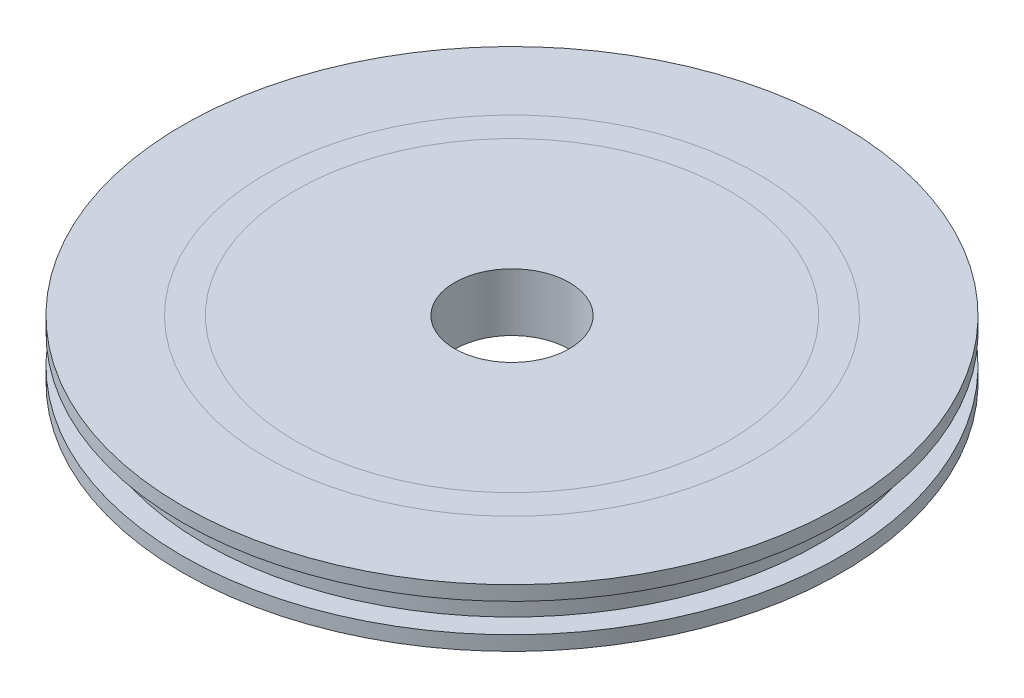
ISO-10303-21;
HEADER;
FILE_DESCRIPTION(('STEP AP214'),'2;1');
FILE_NAME('part.step','',(''),(''),'','','');
FILE_SCHEMA(('AUTOMOTIVE_DESIGN { 1 0 10303 214 1 1 1 1 }'));
ENDSEC;
DATA;
#1=APPLICATION_CONTEXT('core data for automotive mechanical design processes');
#2=APPLICATION_PROTOCOL_DEFINITION('international standard','automotive_design',2000,#1);
#3=PRODUCT_CONTEXT('',#1,'mechanical');
#4=PRODUCT('Part','Part','',(#3));
#5=PRODUCT_RELATED_PRODUCT_CATEGORY('part','',(#4));
#6=PRODUCT_DEFINITION_FORMATION('','',#4);
#7=PRODUCT_DEFINITION_CONTEXT('part definition',#1,'design');
#8=PRODUCT_DEFINITION('design','',#6,#7);
#9=PRODUCT_DEFINITION_SHAPE('','',#8);
#10=(LENGTH_UNIT() NAMED_UNIT(*) SI_UNIT(.MILLI.,.METRE.));
#11=(NAMED_UNIT(*) PLANE_ANGLE_UNIT() SI_UNIT($,.RADIAN.));
#12=(NAMED_UNIT(*) SI_UNIT($,.STERADIAN.) SOLID_ANGLE_UNIT());
#13=UNCERTAINTY_MEASURE_WITH_UNIT(LENGTH_MEASURE(1.E-05),#10,'distance_accuracy_value','');
#14=(GEOMETRIC_REPRESENTATION_CONTEXT(3) GLOBAL_UNCERTAINTY_ASSIGNED_CONTEXT((#13)) GLOBAL_UNIT_ASSIGNED_CONTEXT((#10,
#11,#12)) REPRESENTATION_CONTEXT('',''));
#15=CARTESIAN_POINT('',(0.,0.,0.));
#16=DIRECTION('',(0.,0.,1.));
#17=DIRECTION('',(1.,0.,0.));
#18=AXIS2_PLACEMENT_3D('',#15,#16,#17);
#19=CARTESIAN_POINT('',(0.,0.,28.956));
#20=DIRECTION('',(0.,1.,0.));
#21=DIRECTION('',(0.,0.,1.));
#22=AXIS2_PLACEMENT_3D('',#19,#20,#21);
#23=PLANE('',#22);
#24=CARTESIAN_POINT('',(0.,0.,0.));
#25=DIRECTION('',(0.,1.,0.));
#26=DIRECTION('',(0.,0.,1.));
#27=AXIS2_PLACEMENT_3D('',#24,#25,#26);
#28=CIRCLE('',#27,28.956);
#29=CARTESIAN_POINT('',(0.,0.,28.956));
#30=VERTEX_POINT('',#29);
#31=EDGE_CURVE('E80',#30,#30,#28,.T.);
#32=ORIENTED_EDGE('',*,*,#31,.T.);
#33=EDGE_LOOP('',(#32));
#34=FACE_BOUND('',#33,.T.);
#35=CARTESIAN_POINT('',(0.,0.,0.));
#36=DIRECTION('',(0.,1.,0.));
#37=DIRECTION('',(0.,0.,1.));
#38=AXIS2_PLACEMENT_3D('',#35,#36,#37);
#39=CIRCLE('',#38,21.59);
#40=CARTESIAN_POINT('',(0.,0.,21.59));
#41=VERTEX_POINT('',#40);
#42=EDGE_CURVE('E10',#41,#41,#39,.F.);
#43=ORIENTED_EDGE('',*,*,#42,.T.);
#44=EDGE_LOOP('',(#43));
#45=FACE_BOUND('',#44,.T.);
#46=ADVANCED_FACE('F40',(#34,#45),#23,.T.);
#47=ORIENTED_EDGE('',*,*,#42,.F.);
#48=EDGE_LOOP('',(#47));
#49=FACE_BOUND('',#48,.T.);
#50=CARTESIAN_POINT('',(0.,0.,0.));
#51=DIRECTION('',(0.,1.,0.));
#52=DIRECTION('',(0.,0.,1.));
#53=AXIS2_PLACEMENT_3D('',#50,#51,#52);
#54=CIRCLE('',#53,19.05);
#55=CARTESIAN_POINT('',(0.,0.,19.05));
#56=VERTEX_POINT('',#55);
#57=EDGE_CURVE('E48',#56,#56,#54,.F.);
#58=ORIENTED_EDGE('',*,*,#57,.T.);
#59=EDGE_LOOP('',(#58));
#60=FACE_BOUND('',#59,.T.);
#61=ADVANCED_FACE('F138',(#49,#60),#23,.T.);
#62=CARTESIAN_POINT('',(0.,0.,0.));
#63=DIRECTION('',(0.,-1.,0.));
#64=DIRECTION('',(0.,0.,-1.));
#65=AXIS2_PLACEMENT_3D('',#62,#63,#64);
#66=CIRCLE('',#65,5.0419);
#67=CARTESIAN_POINT('',(0.,0.,-5.0419));
#68=VERTEX_POINT('',#67);
#69=EDGE_CURVE('E84',#68,#68,#66,.T.);
#70=ORIENTED_EDGE('',*,*,#69,.T.);
#71=EDGE_LOOP('',(#70));
#72=FACE_BOUND('',#71,.T.);
#73=ORIENTED_EDGE('',*,*,#57,.F.);
#74=EDGE_LOOP('',(#73));
#75=FACE_BOUND('',#74,.T.);
#76=ADVANCED_FACE('F42',(#72,#75),#23,.T.);
#77=CARTESIAN_POINT('',(0.,-5.08,0.));
#78=DIRECTION('',(0.,-1.,0.));
#79=DIRECTION('',(0.,0.,-1.));
#80=AXIS2_PLACEMENT_3D('',#77,#78,#79);
#81=PLANE('',#80);
#82=CARTESIAN_POINT('',(0.,-5.08,0.));
#83=DIRECTION('',(0.,-1.,0.));
#84=DIRECTION('',(0.,0.,-1.));
#85=AXIS2_PLACEMENT_3D('',#82,#83,#84);
#86=CIRCLE('',#85,5.0419);
#87=CARTESIAN_POINT('',(0.,-5.08,-5.0419));
#88=VERTEX_POINT('',#87);
#89=EDGE_CURVE('E85',#88,#88,#86,.T.);
#90=ORIENTED_EDGE('',*,*,#89,.F.);
#91=EDGE_LOOP('',(#90));
#92=FACE_BOUND('',#91,.T.);
#93=CARTESIAN_POINT('',(0.,-5.08,0.));
#94=DIRECTION('',(0.,1.,0.));
#95=DIRECTION('',(0.,0.,1.));
#96=AXIS2_PLACEMENT_3D('',#93,#94,#95);
#97=CIRCLE('',#96,28.956);
#98=CARTESIAN_POINT('',(0.,-5.08,28.956));
#99=VERTEX_POINT('',#98);
#100=EDGE_CURVE('E55',#99,#99,#97,.T.);
#101=ORIENTED_EDGE('',*,*,#100,.F.);
#102=EDGE_LOOP('',(#101));
#103=FACE_BOUND('',#102,.T.);
#104=ADVANCED_FACE('F103',(#92,#103),#81,.T.);
#105=CARTESIAN_POINT('',(0.,0.,0.));
#106=DIRECTION('',(0.,1.,0.));
#107=DIRECTION('',(0.,0.,1.));
#108=AXIS2_PLACEMENT_3D('',#105,#106,#107);
#109=CYLINDRICAL_SURFACE('',#108,28.9559999999895);
#110=ORIENTED_EDGE('',*,*,#100,.T.);
#111=EDGE_LOOP('',(#110));
#112=FACE_BOUND('',#111,.T.);
#113=CARTESIAN_POINT('',(0.,-3.81,0.));
#114=DIRECTION('',(0.,1.,0.));
#115=DIRECTION('',(0.,0.,1.));
#116=AXIS2_PLACEMENT_3D('',#113,#114,#115);
#117=CIRCLE('',#116,28.9559999999791);
#118=CARTESIAN_POINT('',(0.,-3.81,28.9559999999791));
#119=VERTEX_POINT('',#118);
#120=EDGE_CURVE('E62',#119,#119,#117,.T.);
#121=ORIENTED_EDGE('',*,*,#120,.F.);
#122=EDGE_LOOP('',(#121));
#123=FACE_BOUND('',#122,.T.);
#124=ADVANCED_FACE('F106',(#112,#123),#109,.T.);
#125=CARTESIAN_POINT('',(0.,-3.81,28.9559999999791));
#126=DIRECTION('',(0.,1.,0.));
#127=DIRECTION('',(0.,0.,1.));
#128=AXIS2_PLACEMENT_3D('',#125,#126,#127);
#129=PLANE('',#128);
#130=ORIENTED_EDGE('',*,*,#120,.T.);
#131=EDGE_LOOP('',(#130));
#132=FACE_BOUND('',#131,.T.);
#133=CARTESIAN_POINT('',(0.,-3.81,0.));
#134=DIRECTION('',(0.,1.,0.));
#135=DIRECTION('',(0.,0.,1.));
#136=AXIS2_PLACEMENT_3D('',#133,#134,#135);
#137=CIRCLE('',#136,27.051);
#138=CARTESIAN_POINT('',(0.,-3.81,27.051));
#139=VERTEX_POINT('',#138);
#140=EDGE_CURVE('E68',#139,#139,#137,.T.);
#141=ORIENTED_EDGE('',*,*,#140,.F.);
#142=EDGE_LOOP('',(#141));
#143=FACE_BOUND('',#142,.T.);
#144=ADVANCED_FACE('F111',(#132,#143),#129,.T.);
#145=CARTESIAN_POINT('',(0.,0.,0.));
#146=DIRECTION('',(0.,1.,0.));
#147=DIRECTION('',(0.,0.,1.));
#148=AXIS2_PLACEMENT_3D('',#145,#146,#147);
#149=CYLINDRICAL_SURFACE('',#148,27.051);
#150=ORIENTED_EDGE('',*,*,#140,.T.);
#151=EDGE_LOOP('',(#150));
#152=FACE_BOUND('',#151,.T.);
#153=CARTESIAN_POINT('',(0.,-1.27,0.));
#154=DIRECTION('',(0.,1.,0.));
#155=DIRECTION('',(0.,0.,1.));
#156=AXIS2_PLACEMENT_3D('',#153,#154,#155);
#157=CIRCLE('',#156,27.051);
#158=CARTESIAN_POINT('',(0.,-1.27,27.051));
#159=VERTEX_POINT('',#158);
#160=EDGE_CURVE('E72',#159,#159,#157,.T.);
#161=ORIENTED_EDGE('',*,*,#160,.F.);
#162=EDGE_LOOP('',(#161));
#163=FACE_BOUND('',#162,.T.);
#164=ADVANCED_FACE('F117',(#152,#163),#149,.T.);
#165=CARTESIAN_POINT('',(0.,-1.27,27.051));
#166=DIRECTION('',(0.,-1.,0.));
#167=DIRECTION('',(0.,0.,-1.));
#168=AXIS2_PLACEMENT_3D('',#165,#166,#167);
#169=PLANE('',#168);
#170=ORIENTED_EDGE('',*,*,#160,.T.);
#171=EDGE_LOOP('',(#170));
#172=FACE_BOUND('',#171,.T.);
#173=CARTESIAN_POINT('',(0.,-1.27,0.));
#174=DIRECTION('',(0.,1.,0.));
#175=DIRECTION('',(0.,0.,1.));
#176=AXIS2_PLACEMENT_3D('',#173,#174,#175);
#177=CIRCLE('',#176,28.9559999999791);
#178=CARTESIAN_POINT('',(0.,-1.27,28.9559999999791));
#179=VERTEX_POINT('',#178);
#180=EDGE_CURVE('E76',#179,#179,#177,.T.);
#181=ORIENTED_EDGE('',*,*,#180,.F.);
#182=EDGE_LOOP('',(#181));
#183=FACE_BOUND('',#182,.T.);
#184=ADVANCED_FACE('F123',(#172,#183),#169,.T.);
#185=CARTESIAN_POINT('',(0.,0.,0.));
#186=DIRECTION('',(0.,1.,0.));
#187=DIRECTION('',(0.,0.,1.));
#188=AXIS2_PLACEMENT_3D('',#185,#186,#187);
#189=CYLINDRICAL_SURFACE('',#188,28.9559999999895);
#190=ORIENTED_EDGE('',*,*,#180,.T.);
#191=EDGE_LOOP('',(#190));
#192=FACE_BOUND('',#191,.T.);
#193=ORIENTED_EDGE('',*,*,#31,.F.);
#194=EDGE_LOOP('',(#193));
#195=FACE_BOUND('',#194,.T.);
#196=ADVANCED_FACE('F99',(#192,#195),#189,.T.);
#197=CARTESIAN_POINT('',(0.,0.,0.));
#198=DIRECTION('',(0.,-1.,0.));
#199=DIRECTION('',(0.,0.,-1.));
#200=AXIS2_PLACEMENT_3D('',#197,#198,#199);
#201=CYLINDRICAL_SURFACE('',#200,5.0419);
#202=ORIENTED_EDGE('',*,*,#69,.F.);
#203=EDGE_LOOP('',(#202));
#204=FACE_BOUND('',#203,.T.);
#205=ORIENTED_EDGE('',*,*,#89,.T.);
#206=EDGE_LOOP('',(#205));
#207=FACE_BOUND('',#206,.T.);
#208=ADVANCED_FACE('F96',(#204,#207),#201,.F.);
#209=CLOSED_SHELL('',(#46,#61,#76,#104,#124,#144,#164,#184,#196,#208));
#210=MANIFOLD_SOLID_BREP('B2',#209);
#211=ADVANCED_BREP_SHAPE_REPRESENTATION('',(#18,#210),#14);
#212=SHAPE_DEFINITION_REPRESENTATION(#9,#211);
ENDSEC;
END-ISO-10303-21;
